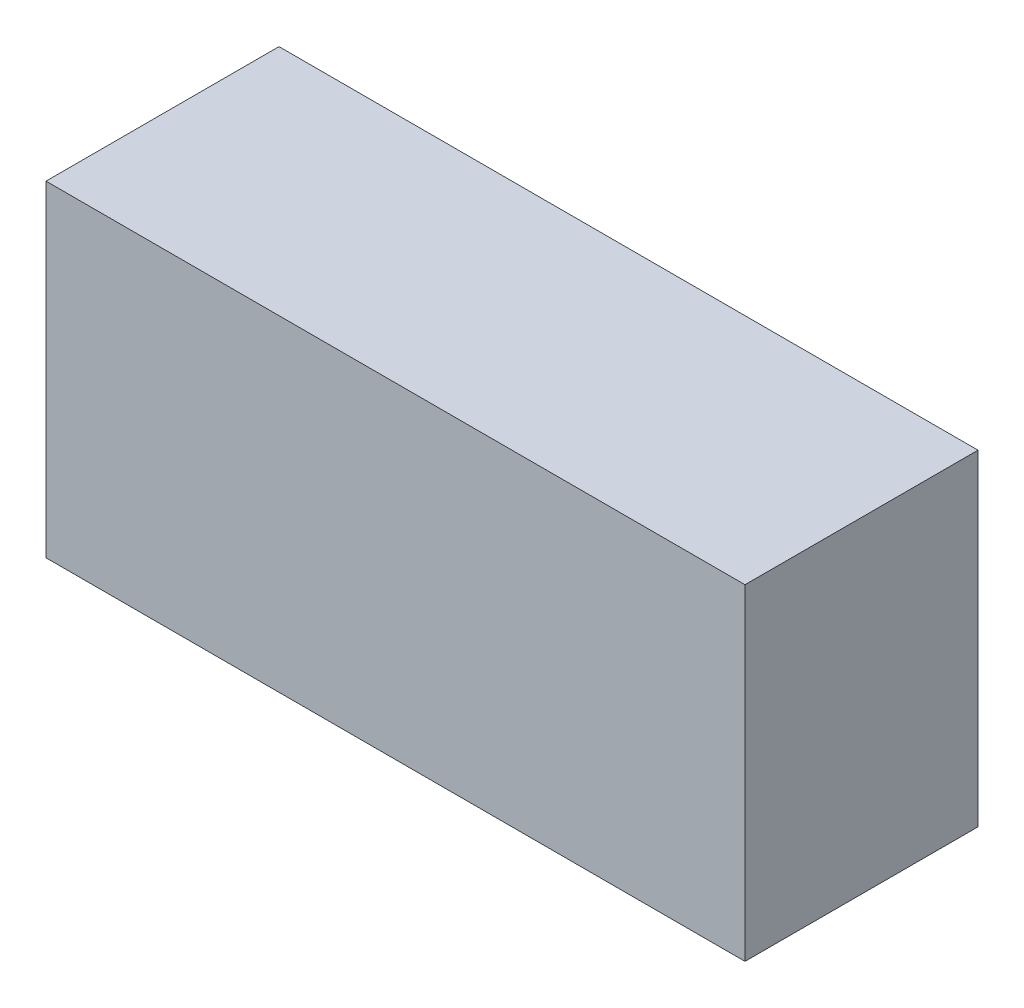
ISO-10303-21;
HEADER;
FILE_DESCRIPTION(('STEP AP214'),'2;1');
FILE_NAME('part.step','',(''),(''),'','','');
FILE_SCHEMA(('AUTOMOTIVE_DESIGN { 1 0 10303 214 1 1 1 1 }'));
ENDSEC;
DATA;
#1=APPLICATION_CONTEXT('core data for automotive mechanical design processes');
#2=APPLICATION_PROTOCOL_DEFINITION('international standard','automotive_design',2000,#1);
#3=PRODUCT_CONTEXT('',#1,'mechanical');
#4=PRODUCT('Part','Part','',(#3));
#5=PRODUCT_RELATED_PRODUCT_CATEGORY('part','',(#4));
#6=PRODUCT_DEFINITION_FORMATION('','',#4);
#7=PRODUCT_DEFINITION_CONTEXT('part definition',#1,'design');
#8=PRODUCT_DEFINITION('design','',#6,#7);
#9=PRODUCT_DEFINITION_SHAPE('','',#8);
#10=(LENGTH_UNIT() NAMED_UNIT(*) SI_UNIT(.MILLI.,.METRE.));
#11=(NAMED_UNIT(*) PLANE_ANGLE_UNIT() SI_UNIT($,.RADIAN.));
#12=(NAMED_UNIT(*) SI_UNIT($,.STERADIAN.) SOLID_ANGLE_UNIT());
#13=UNCERTAINTY_MEASURE_WITH_UNIT(LENGTH_MEASURE(1.E-05),#10,'distance_accuracy_value','');
#14=(GEOMETRIC_REPRESENTATION_CONTEXT(3) GLOBAL_UNCERTAINTY_ASSIGNED_CONTEXT((#13)) GLOBAL_UNIT_ASSIGNED_CONTEXT((#10,
#11,#12)) REPRESENTATION_CONTEXT('',''));
#15=CARTESIAN_POINT('',(0.,0.,0.));
#16=DIRECTION('',(0.,0.,1.));
#17=DIRECTION('',(1.,0.,0.));
#18=AXIS2_PLACEMENT_3D('',#15,#16,#17);
#19=CARTESIAN_POINT('',(56.8196449313236,57.7493220657426,2.00152));
#20=DIRECTION('',(0.,0.,1.));
#21=DIRECTION('',(1.,0.,0.));
#22=AXIS2_PLACEMENT_3D('',#19,#20,#21);
#23=PLANE('',#22);
#24=DIRECTION('',(1.,0.,0.));
#25=VECTOR('',#24,1.);
#26=CARTESIAN_POINT('',(58.800820165587,57.7848841068104,2.00152));
#27=LINE('',#26,#25);
#28=CARTESIAN_POINT('',(56.8958439787982,57.7848841068104,2.00152));
#29=VERTEX_POINT('',#28);
#30=CARTESIAN_POINT('',(60.7057963523758,57.7848841068104,2.00152));
#31=VERTEX_POINT('',#30);
#32=EDGE_CURVE('E76',#29,#31,#27,.T.);
#33=ORIENTED_EDGE('',*,*,#32,.T.);
#34=DIRECTION('',(0.,1.,0.));
#35=VECTOR('',#34,1.);
#36=CARTESIAN_POINT('',(60.7057963523758,58.6739351333403,2.00152));
#37=LINE('',#36,#35);
#38=CARTESIAN_POINT('',(60.7057963523758,59.5629861598702,2.00152));
#39=VERTEX_POINT('',#38);
#40=EDGE_CURVE('E58',#31,#39,#37,.T.);
#41=ORIENTED_EDGE('',*,*,#40,.T.);
#42=DIRECTION('',(-1.,0.,0.));
#43=VECTOR('',#42,1.);
#44=CARTESIAN_POINT('',(58.800820165587,59.5629861598702,2.00152));
#45=LINE('',#44,#43);
#46=CARTESIAN_POINT('',(56.8958439787982,59.5629861598702,2.00152));
#47=VERTEX_POINT('',#46);
#48=EDGE_CURVE('E20',#39,#47,#45,.T.);
#49=ORIENTED_EDGE('',*,*,#48,.T.);
#50=DIRECTION('',(0.,-1.,0.));
#51=VECTOR('',#50,1.);
#52=CARTESIAN_POINT('',(56.8958439787982,58.6739351333403,2.00152));
#53=LINE('',#52,#51);
#54=EDGE_CURVE('E55',#47,#29,#53,.T.);
#55=ORIENTED_EDGE('',*,*,#54,.T.);
#56=EDGE_LOOP('',(#33,#41,#49,#55));
#57=FACE_BOUND('',#56,.T.);
#58=ADVANCED_FACE('F16',(#57),#23,.T.);
#59=CARTESIAN_POINT('',(56.8196449313236,59.5629861598702,0.70612));
#60=DIRECTION('',(0.,-1.,0.));
#61=DIRECTION('',(1.,0.,0.));
#62=AXIS2_PLACEMENT_3D('',#59,#60,#61);
#63=PLANE('',#62);
#64=ORIENTED_EDGE('',*,*,#48,.F.);
#65=DIRECTION('',(0.,0.,-1.));
#66=VECTOR('',#65,1.);
#67=CARTESIAN_POINT('',(60.7057963523758,59.5629861598702,1.36652));
#68=LINE('',#67,#66);
#69=CARTESIAN_POINT('',(60.7057963523758,59.5629861598702,0.73152));
#70=VERTEX_POINT('',#69);
#71=EDGE_CURVE('E80',#39,#70,#68,.T.);
#72=ORIENTED_EDGE('',*,*,#71,.T.);
#73=DIRECTION('',(-1.,0.,0.));
#74=VECTOR('',#73,1.);
#75=CARTESIAN_POINT('',(58.800820165587,59.5629861598702,0.73152));
#76=LINE('',#75,#74);
#77=CARTESIAN_POINT('',(56.8958439787982,59.5629861598702,0.73152));
#78=VERTEX_POINT('',#77);
#79=EDGE_CURVE('E73',#70,#78,#76,.T.);
#80=ORIENTED_EDGE('',*,*,#79,.T.);
#81=DIRECTION('',(0.,0.,1.));
#82=VECTOR('',#81,1.);
#83=CARTESIAN_POINT('',(56.8958439787982,59.5629861598702,1.36652));
#84=LINE('',#83,#82);
#85=EDGE_CURVE('E63',#78,#47,#84,.T.);
#86=ORIENTED_EDGE('',*,*,#85,.T.);
#87=EDGE_LOOP('',(#64,#72,#80,#86));
#88=FACE_BOUND('',#87,.T.);
#89=ADVANCED_FACE('F72',(#88),#63,.F.);
#90=CARTESIAN_POINT('',(56.8958439787982,57.7493220657426,0.70612));
#91=DIRECTION('',(1.,0.,0.));
#92=DIRECTION('',(0.,1.,0.));
#93=AXIS2_PLACEMENT_3D('',#90,#91,#92);
#94=PLANE('',#93);
#95=ORIENTED_EDGE('',*,*,#54,.F.);
#96=ORIENTED_EDGE('',*,*,#85,.F.);
#97=DIRECTION('',(0.,-1.,0.));
#98=VECTOR('',#97,1.);
#99=CARTESIAN_POINT('',(56.8958439787982,58.6739351333403,0.73152));
#100=LINE('',#99,#98);
#101=CARTESIAN_POINT('',(56.8958439787982,57.7848841068104,0.73152));
#102=VERTEX_POINT('',#101);
#103=EDGE_CURVE('E83',#78,#102,#100,.T.);
#104=ORIENTED_EDGE('',*,*,#103,.T.);
#105=DIRECTION('',(0.,0.,1.));
#106=VECTOR('',#105,1.);
#107=CARTESIAN_POINT('',(56.8958439787982,57.7848841068104,1.36652));
#108=LINE('',#107,#106);
#109=EDGE_CURVE('E69',#102,#29,#108,.T.);
#110=ORIENTED_EDGE('',*,*,#109,.T.);
#111=EDGE_LOOP('',(#95,#96,#104,#110));
#112=FACE_BOUND('',#111,.T.);
#113=ADVANCED_FACE('F66',(#112),#94,.F.);
#114=CARTESIAN_POINT('',(60.7819953998504,57.7848841068104,0.70612));
#115=DIRECTION('',(0.,1.,0.));
#116=DIRECTION('',(-1.,0.,0.));
#117=AXIS2_PLACEMENT_3D('',#114,#115,#116);
#118=PLANE('',#117);
#119=ORIENTED_EDGE('',*,*,#32,.F.);
#120=ORIENTED_EDGE('',*,*,#109,.F.);
#121=DIRECTION('',(1.,0.,0.));
#122=VECTOR('',#121,1.);
#123=CARTESIAN_POINT('',(58.800820165587,57.7848841068104,0.73152));
#124=LINE('',#123,#122);
#125=CARTESIAN_POINT('',(60.7057963523758,57.7848841068104,0.73152));
#126=VERTEX_POINT('',#125);
#127=EDGE_CURVE('E26',#102,#126,#124,.T.);
#128=ORIENTED_EDGE('',*,*,#127,.T.);
#129=DIRECTION('',(0.,0.,1.));
#130=VECTOR('',#129,1.);
#131=CARTESIAN_POINT('',(60.7057963523758,57.7848841068104,1.36652));
#132=LINE('',#131,#130);
#133=EDGE_CURVE('E34',#126,#31,#132,.T.);
#134=ORIENTED_EDGE('',*,*,#133,.T.);
#135=EDGE_LOOP('',(#119,#120,#128,#134));
#136=FACE_BOUND('',#135,.T.);
#137=ADVANCED_FACE('F88',(#136),#118,.F.);
#138=CARTESIAN_POINT('',(60.7057963523758,59.598548200938,0.70612));
#139=DIRECTION('',(-1.,0.,0.));
#140=DIRECTION('',(0.,-1.,0.));
#141=AXIS2_PLACEMENT_3D('',#138,#139,#140);
#142=PLANE('',#141);
#143=ORIENTED_EDGE('',*,*,#40,.F.);
#144=ORIENTED_EDGE('',*,*,#133,.F.);
#145=DIRECTION('',(0.,1.,0.));
#146=VECTOR('',#145,1.);
#147=CARTESIAN_POINT('',(60.7057963523758,58.6739351333403,0.73152));
#148=LINE('',#147,#146);
#149=EDGE_CURVE('E11',#126,#70,#148,.T.);
#150=ORIENTED_EDGE('',*,*,#149,.T.);
#151=ORIENTED_EDGE('',*,*,#71,.F.);
#152=EDGE_LOOP('',(#143,#144,#150,#151));
#153=FACE_BOUND('',#152,.T.);
#154=ADVANCED_FACE('F90',(#153),#142,.F.);
#155=CARTESIAN_POINT('',(56.8196449313236,57.7493220657426,0.73152));
#156=DIRECTION('',(0.,0.,1.));
#157=DIRECTION('',(1.,0.,0.));
#158=AXIS2_PLACEMENT_3D('',#155,#156,#157);
#159=PLANE('',#158);
#160=ORIENTED_EDGE('',*,*,#127,.F.);
#161=ORIENTED_EDGE('',*,*,#103,.F.);
#162=ORIENTED_EDGE('',*,*,#79,.F.);
#163=ORIENTED_EDGE('',*,*,#149,.F.);
#164=EDGE_LOOP('',(#160,#161,#162,#163));
#165=FACE_BOUND('',#164,.T.);
#166=ADVANCED_FACE('F18',(#165),#159,.F.);
#167=CLOSED_SHELL('',(#58,#89,#113,#137,#154,#166));
#168=MANIFOLD_SOLID_BREP('B1',#167);
#169=ADVANCED_BREP_SHAPE_REPRESENTATION('',(#18,#168),#14);
#170=SHAPE_DEFINITION_REPRESENTATION(#9,#169);
ENDSEC;
END-ISO-10303-21;
